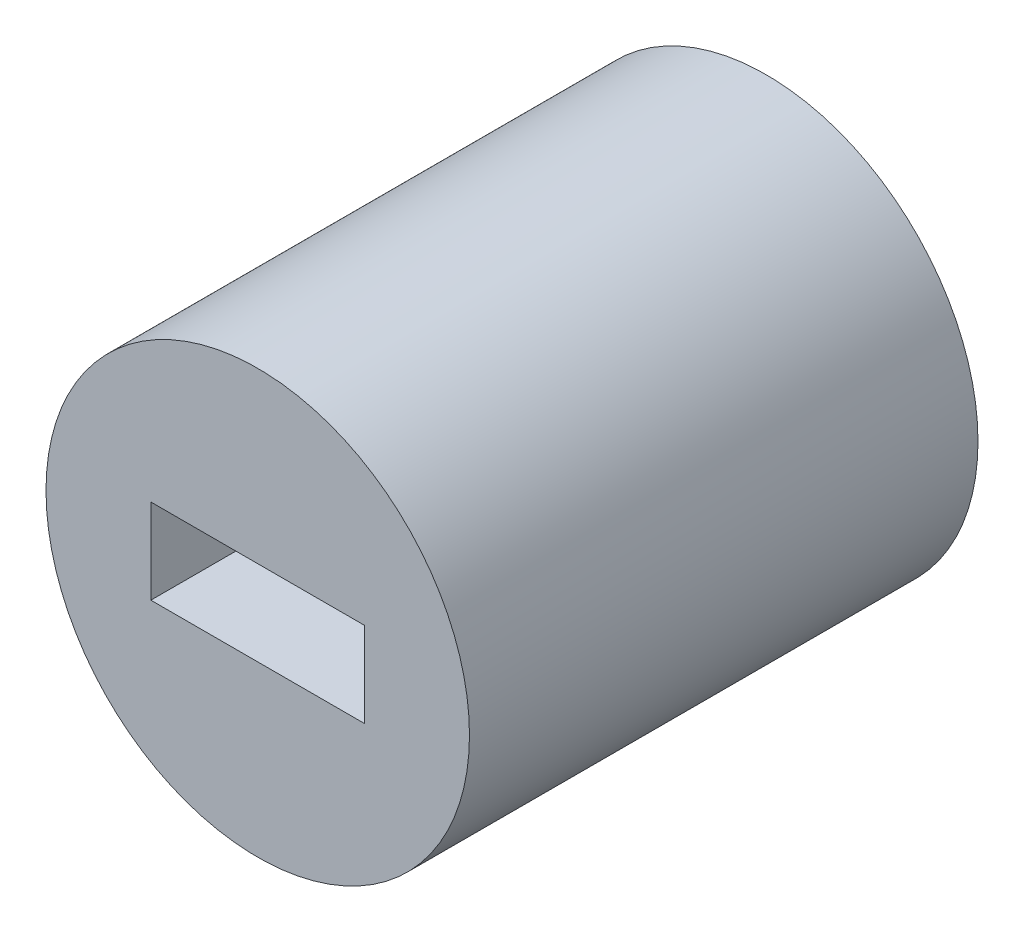
ISO-10303-21;
HEADER;
FILE_DESCRIPTION(('STEP AP214'),'2;1');
FILE_NAME('part.step','',(''),(''),'','','');
FILE_SCHEMA(('AUTOMOTIVE_DESIGN { 1 0 10303 214 1 1 1 1 }'));
ENDSEC;
DATA;
#1=APPLICATION_CONTEXT('core data for automotive mechanical design processes');
#2=APPLICATION_PROTOCOL_DEFINITION('international standard','automotive_design',2000,#1);
#3=PRODUCT_CONTEXT('',#1,'mechanical');
#4=PRODUCT('Part','Part','',(#3));
#5=PRODUCT_RELATED_PRODUCT_CATEGORY('part','',(#4));
#6=PRODUCT_DEFINITION_FORMATION('','',#4);
#7=PRODUCT_DEFINITION_CONTEXT('part definition',#1,'design');
#8=PRODUCT_DEFINITION('design','',#6,#7);
#9=PRODUCT_DEFINITION_SHAPE('','',#8);
#10=(LENGTH_UNIT() NAMED_UNIT(*) SI_UNIT(.MILLI.,.METRE.));
#11=(NAMED_UNIT(*) PLANE_ANGLE_UNIT() SI_UNIT($,.RADIAN.));
#12=(NAMED_UNIT(*) SI_UNIT($,.STERADIAN.) SOLID_ANGLE_UNIT());
#13=UNCERTAINTY_MEASURE_WITH_UNIT(LENGTH_MEASURE(1.E-05),#10,'distance_accuracy_value','');
#14=(GEOMETRIC_REPRESENTATION_CONTEXT(3) GLOBAL_UNCERTAINTY_ASSIGNED_CONTEXT((#13)) GLOBAL_UNIT_ASSIGNED_CONTEXT((#10,
#11,#12)) REPRESENTATION_CONTEXT('',''));
#15=CARTESIAN_POINT('',(0.,0.,0.));
#16=DIRECTION('',(0.,0.,1.));
#17=DIRECTION('',(1.,0.,0.));
#18=AXIS2_PLACEMENT_3D('',#15,#16,#17);
#19=CARTESIAN_POINT('',(-0.64100581951225,0.,3.05));
#20=DIRECTION('',(1.,0.,0.));
#21=DIRECTION('',(0.,1.,0.));
#22=AXIS2_PLACEMENT_3D('',#19,#20,#21);
#23=PLANE('',#22);
#24=DIRECTION('',(0.,1.,0.));
#25=VECTOR('',#24,1.);
#26=CARTESIAN_POINT('',(-0.64100581951225,0.,1.55));
#27=LINE('',#26,#25);
#28=CARTESIAN_POINT('',(-0.64100581951225,0.255,1.55));
#29=VERTEX_POINT('',#28);
#30=CARTESIAN_POINT('',(-0.64100581951225,-0.255,1.55));
#31=VERTEX_POINT('',#30);
#32=EDGE_CURVE('E112',#29,#31,#27,.F.);
#33=ORIENTED_EDGE('',*,*,#32,.F.);
#34=DIRECTION('',(0.,0.,1.));
#35=VECTOR('',#34,1.);
#36=CARTESIAN_POINT('',(-0.64100581951225,0.255,3.05));
#37=LINE('',#36,#35);
#38=CARTESIAN_POINT('',(-0.64100581951225,0.255,3.05));
#39=VERTEX_POINT('',#38);
#40=EDGE_CURVE('E120',#39,#29,#37,.F.);
#41=ORIENTED_EDGE('',*,*,#40,.F.);
#42=DIRECTION('',(0.,1.,0.));
#43=VECTOR('',#42,1.);
#44=CARTESIAN_POINT('',(-0.64100581951225,0.,3.05));
#45=LINE('',#44,#43);
#46=CARTESIAN_POINT('',(-0.64100581951225,-0.255,3.05));
#47=VERTEX_POINT('',#46);
#48=EDGE_CURVE('E30',#39,#47,#45,.F.);
#49=ORIENTED_EDGE('',*,*,#48,.T.);
#50=DIRECTION('',(0.,0.,1.));
#51=VECTOR('',#50,1.);
#52=CARTESIAN_POINT('',(-0.64100581951225,-0.255,3.05));
#53=LINE('',#52,#51);
#54=EDGE_CURVE('E117',#31,#47,#53,.T.);
#55=ORIENTED_EDGE('',*,*,#54,.F.);
#56=EDGE_LOOP('',(#33,#41,#49,#55));
#57=FACE_BOUND('',#56,.T.);
#58=ADVANCED_FACE('F14',(#57),#23,.T.);
#59=CARTESIAN_POINT('',(0.,0.,1.55));
#60=DIRECTION('',(0.,0.,1.));
#61=DIRECTION('',(1.,0.,0.));
#62=AXIS2_PLACEMENT_3D('',#59,#60,#61);
#63=PLANE('',#62);
#64=DIRECTION('',(-1.,0.,0.));
#65=VECTOR('',#64,1.);
#66=CARTESIAN_POINT('',(0.528723609904574,-0.255,1.55));
#67=LINE('',#66,#65);
#68=CARTESIAN_POINT('',(-0.416441400296898,-0.255,1.55));
#69=VERTEX_POINT('',#68);
#70=EDGE_CURVE('E125',#69,#31,#67,.T.);
#71=ORIENTED_EDGE('',*,*,#70,.F.);
#72=DIRECTION('',(0.,-1.,0.));
#73=VECTOR('',#72,1.);
#74=CARTESIAN_POINT('',(-0.416441400296898,0.,1.55));
#75=LINE('',#74,#73);
#76=CARTESIAN_POINT('',(-0.416441400296898,0.255,1.55));
#77=VERTEX_POINT('',#76);
#78=EDGE_CURVE('E110',#69,#77,#75,.F.);
#79=ORIENTED_EDGE('',*,*,#78,.T.);
#80=DIRECTION('',(1.,0.,0.));
#81=VECTOR('',#80,1.);
#82=CARTESIAN_POINT('',(-0.528723609904574,0.255,1.55));
#83=LINE('',#82,#81);
#84=EDGE_CURVE('E146',#29,#77,#83,.T.);
#85=ORIENTED_EDGE('',*,*,#84,.F.);
#86=ORIENTED_EDGE('',*,*,#32,.T.);
#87=EDGE_LOOP('',(#71,#79,#85,#86));
#88=FACE_BOUND('',#87,.T.);
#89=ADVANCED_FACE('F157',(#88),#63,.T.);
#90=CARTESIAN_POINT('',(-0.416441400296898,0.,3.05));
#91=DIRECTION('',(-1.,0.,0.));
#92=DIRECTION('',(0.,-1.,0.));
#93=AXIS2_PLACEMENT_3D('',#90,#91,#92);
#94=PLANE('',#93);
#95=DIRECTION('',(0.,0.,1.));
#96=VECTOR('',#95,1.);
#97=CARTESIAN_POINT('',(-0.416441400296898,0.255,3.05));
#98=LINE('',#97,#96);
#99=CARTESIAN_POINT('',(-0.416441400296898,0.255,0.));
#100=VERTEX_POINT('',#99);
#101=EDGE_CURVE('E143',#77,#100,#98,.F.);
#102=ORIENTED_EDGE('',*,*,#101,.F.);
#103=ORIENTED_EDGE('',*,*,#78,.F.);
#104=DIRECTION('',(0.,0.,1.));
#105=VECTOR('',#104,1.);
#106=CARTESIAN_POINT('',(-0.416441400296898,-0.255,3.05));
#107=LINE('',#106,#105);
#108=CARTESIAN_POINT('',(-0.416441400296898,-0.255,0.));
#109=VERTEX_POINT('',#108);
#110=EDGE_CURVE('E94',#109,#69,#107,.T.);
#111=ORIENTED_EDGE('',*,*,#110,.F.);
#112=DIRECTION('',(0.,-1.,0.));
#113=VECTOR('',#112,1.);
#114=CARTESIAN_POINT('',(-0.416441400296898,0.,0.));
#115=LINE('',#114,#113);
#116=EDGE_CURVE('E108',#100,#109,#115,.T.);
#117=ORIENTED_EDGE('',*,*,#116,.F.);
#118=EDGE_LOOP('',(#102,#103,#111,#117));
#119=FACE_BOUND('',#118,.T.);
#120=ADVANCED_FACE('F154',(#119),#94,.F.);
#121=CARTESIAN_POINT('',(0.416441400296898,0.,3.05));
#122=DIRECTION('',(1.,0.,0.));
#123=DIRECTION('',(0.,1.,0.));
#124=AXIS2_PLACEMENT_3D('',#121,#122,#123);
#125=PLANE('',#124);
#126=DIRECTION('',(0.,0.,1.));
#127=VECTOR('',#126,1.);
#128=CARTESIAN_POINT('',(0.416441400296898,-0.255,3.05));
#129=LINE('',#128,#127);
#130=CARTESIAN_POINT('',(0.416441400296898,-0.255,1.55));
#131=VERTEX_POINT('',#130);
#132=CARTESIAN_POINT('',(0.416441400296898,-0.255,0.));
#133=VERTEX_POINT('',#132);
#134=EDGE_CURVE('E89',#131,#133,#129,.F.);
#135=ORIENTED_EDGE('',*,*,#134,.F.);
#136=DIRECTION('',(0.,1.,0.));
#137=VECTOR('',#136,1.);
#138=CARTESIAN_POINT('',(0.416441400296898,0.,1.55));
#139=LINE('',#138,#137);
#140=CARTESIAN_POINT('',(0.416441400296898,0.255,1.55));
#141=VERTEX_POINT('',#140);
#142=EDGE_CURVE('E77',#141,#131,#139,.F.);
#143=ORIENTED_EDGE('',*,*,#142,.F.);
#144=DIRECTION('',(0.,0.,1.));
#145=VECTOR('',#144,1.);
#146=CARTESIAN_POINT('',(0.416441400296898,0.255,3.05));
#147=LINE('',#146,#145);
#148=CARTESIAN_POINT('',(0.416441400296898,0.255,0.));
#149=VERTEX_POINT('',#148);
#150=EDGE_CURVE('E141',#149,#141,#147,.T.);
#151=ORIENTED_EDGE('',*,*,#150,.F.);
#152=DIRECTION('',(0.,1.,0.));
#153=VECTOR('',#152,1.);
#154=CARTESIAN_POINT('',(0.416441400296898,0.,0.));
#155=LINE('',#154,#153);
#156=EDGE_CURVE('E86',#133,#149,#155,.T.);
#157=ORIENTED_EDGE('',*,*,#156,.F.);
#158=EDGE_LOOP('',(#135,#143,#151,#157));
#159=FACE_BOUND('',#158,.T.);
#160=ADVANCED_FACE('F90',(#159),#125,.F.);
#161=CARTESIAN_POINT('',(0.,0.,1.55));
#162=DIRECTION('',(0.,0.,1.));
#163=DIRECTION('',(1.,0.,0.));
#164=AXIS2_PLACEMENT_3D('',#161,#162,#163);
#165=PLANE('',#164);
#166=ORIENTED_EDGE('',*,*,#142,.T.);
#167=DIRECTION('',(-1.,0.,0.));
#168=VECTOR('',#167,1.);
#169=CARTESIAN_POINT('',(0.528723609904574,-0.255,1.55));
#170=LINE('',#169,#168);
#171=CARTESIAN_POINT('',(0.64100581951225,-0.255,1.55));
#172=VERTEX_POINT('',#171);
#173=EDGE_CURVE('E74',#172,#131,#170,.T.);
#174=ORIENTED_EDGE('',*,*,#173,.F.);
#175=DIRECTION('',(0.,-1.,0.));
#176=VECTOR('',#175,1.);
#177=CARTESIAN_POINT('',(0.64100581951225,0.,1.55));
#178=LINE('',#177,#176);
#179=CARTESIAN_POINT('',(0.64100581951225,0.255,1.55));
#180=VERTEX_POINT('',#179);
#181=EDGE_CURVE('E85',#180,#172,#178,.T.);
#182=ORIENTED_EDGE('',*,*,#181,.F.);
#183=DIRECTION('',(1.,0.,0.));
#184=VECTOR('',#183,1.);
#185=CARTESIAN_POINT('',(-0.528723609904574,0.255,1.55));
#186=LINE('',#185,#184);
#187=EDGE_CURVE('E81',#141,#180,#186,.T.);
#188=ORIENTED_EDGE('',*,*,#187,.F.);
#189=EDGE_LOOP('',(#166,#174,#182,#188));
#190=FACE_BOUND('',#189,.T.);
#191=ADVANCED_FACE('F79',(#190),#165,.T.);
#192=CARTESIAN_POINT('',(0.64100581951225,0.,3.05));
#193=DIRECTION('',(-1.,0.,0.));
#194=DIRECTION('',(0.,-1.,0.));
#195=AXIS2_PLACEMENT_3D('',#192,#193,#194);
#196=PLANE('',#195);
#197=DIRECTION('',(0.,-1.,0.));
#198=VECTOR('',#197,1.);
#199=CARTESIAN_POINT('',(0.64100581951225,0.,3.05));
#200=LINE('',#199,#198);
#201=CARTESIAN_POINT('',(0.64100581951225,-0.255,3.05));
#202=VERTEX_POINT('',#201);
#203=CARTESIAN_POINT('',(0.64100581951225,0.255,3.05));
#204=VERTEX_POINT('',#203);
#205=EDGE_CURVE('E101',#202,#204,#200,.F.);
#206=ORIENTED_EDGE('',*,*,#205,.T.);
#207=DIRECTION('',(0.,0.,1.));
#208=VECTOR('',#207,1.);
#209=CARTESIAN_POINT('',(0.64100581951225,0.255,3.05));
#210=LINE('',#209,#208);
#211=EDGE_CURVE('E137',#180,#204,#210,.T.);
#212=ORIENTED_EDGE('',*,*,#211,.F.);
#213=ORIENTED_EDGE('',*,*,#181,.T.);
#214=DIRECTION('',(0.,0.,1.));
#215=VECTOR('',#214,1.);
#216=CARTESIAN_POINT('',(0.64100581951225,-0.255,3.05));
#217=LINE('',#216,#215);
#218=EDGE_CURVE('E100',#202,#172,#217,.F.);
#219=ORIENTED_EDGE('',*,*,#218,.F.);
#220=EDGE_LOOP('',(#206,#212,#213,#219));
#221=FACE_BOUND('',#220,.T.);
#222=ADVANCED_FACE('F162',(#221),#196,.T.);
#223=CARTESIAN_POINT('',(0.528723609904574,-0.255,3.05));
#224=DIRECTION('',(0.,1.,0.));
#225=DIRECTION('',(-1.,0.,0.));
#226=AXIS2_PLACEMENT_3D('',#223,#224,#225);
#227=PLANE('',#226);
#228=DIRECTION('',(1.,0.,0.));
#229=VECTOR('',#228,1.);
#230=CARTESIAN_POINT('',(0.,-0.255,3.05));
#231=LINE('',#230,#229);
#232=EDGE_CURVE('E122',#202,#47,#231,.F.);
#233=ORIENTED_EDGE('',*,*,#232,.F.);
#234=ORIENTED_EDGE('',*,*,#218,.T.);
#235=ORIENTED_EDGE('',*,*,#173,.T.);
#236=ORIENTED_EDGE('',*,*,#134,.T.);
#237=DIRECTION('',(1.,0.,0.));
#238=VECTOR('',#237,1.);
#239=CARTESIAN_POINT('',(0.,-0.255,0.));
#240=LINE('',#239,#238);
#241=EDGE_CURVE('E133',#133,#109,#240,.F.);
#242=ORIENTED_EDGE('',*,*,#241,.T.);
#243=ORIENTED_EDGE('',*,*,#110,.T.);
#244=ORIENTED_EDGE('',*,*,#70,.T.);
#245=ORIENTED_EDGE('',*,*,#54,.T.);
#246=EDGE_LOOP('',(#233,#234,#235,#236,#242,#243,#244,#245));
#247=FACE_BOUND('',#246,.T.);
#248=ADVANCED_FACE('F98',(#247),#227,.T.);
#249=CARTESIAN_POINT('',(-0.528723609904574,0.255,3.05));
#250=DIRECTION('',(0.,-1.,0.));
#251=DIRECTION('',(1.,0.,0.));
#252=AXIS2_PLACEMENT_3D('',#249,#250,#251);
#253=PLANE('',#252);
#254=ORIENTED_EDGE('',*,*,#187,.T.);
#255=ORIENTED_EDGE('',*,*,#211,.T.);
#256=DIRECTION('',(1.,0.,0.));
#257=VECTOR('',#256,1.);
#258=CARTESIAN_POINT('',(0.,0.255,3.05));
#259=LINE('',#258,#257);
#260=EDGE_CURVE('E128',#39,#204,#259,.T.);
#261=ORIENTED_EDGE('',*,*,#260,.F.);
#262=ORIENTED_EDGE('',*,*,#40,.T.);
#263=ORIENTED_EDGE('',*,*,#84,.T.);
#264=ORIENTED_EDGE('',*,*,#101,.T.);
#265=DIRECTION('',(1.,0.,0.));
#266=VECTOR('',#265,1.);
#267=CARTESIAN_POINT('',(0.,0.255,0.));
#268=LINE('',#267,#266);
#269=EDGE_CURVE('E129',#100,#149,#268,.T.);
#270=ORIENTED_EDGE('',*,*,#269,.T.);
#271=ORIENTED_EDGE('',*,*,#150,.T.);
#272=EDGE_LOOP('',(#254,#255,#261,#262,#263,#264,#270,#271));
#273=FACE_BOUND('',#272,.T.);
#274=ADVANCED_FACE('F159',(#273),#253,.T.);
#275=CARTESIAN_POINT('',(0.,0.,0.));
#276=DIRECTION('',(0.,0.,1.));
#277=DIRECTION('',(1.,0.,0.));
#278=AXIS2_PLACEMENT_3D('',#275,#276,#277);
#279=PLANE('',#278);
#280=CARTESIAN_POINT('',(0.,0.,0.));
#281=DIRECTION('',(0.,0.,1.));
#282=DIRECTION('',(1.,0.,0.));
#283=AXIS2_PLACEMENT_3D('',#280,#281,#282);
#284=CIRCLE('',#283,1.27);
#285=CARTESIAN_POINT('',(1.27,0.,0.));
#286=VERTEX_POINT('',#285);
#287=EDGE_CURVE('E17',#286,#286,#284,.T.);
#288=ORIENTED_EDGE('',*,*,#287,.F.);
#289=EDGE_LOOP('',(#288));
#290=FACE_BOUND('',#289,.T.);
#291=ORIENTED_EDGE('',*,*,#116,.T.);
#292=ORIENTED_EDGE('',*,*,#241,.F.);
#293=ORIENTED_EDGE('',*,*,#156,.T.);
#294=ORIENTED_EDGE('',*,*,#269,.F.);
#295=EDGE_LOOP('',(#291,#292,#293,#294));
#296=FACE_BOUND('',#295,.T.);
#297=ADVANCED_FACE('F179',(#290,#296),#279,.F.);
#298=CARTESIAN_POINT('',(0.,0.,3.05));
#299=DIRECTION('',(0.,0.,1.));
#300=DIRECTION('',(1.,0.,0.));
#301=AXIS2_PLACEMENT_3D('',#298,#299,#300);
#302=PLANE('',#301);
#303=CARTESIAN_POINT('',(0.,0.,3.05));
#304=DIRECTION('',(0.,0.,1.));
#305=DIRECTION('',(1.,0.,0.));
#306=AXIS2_PLACEMENT_3D('',#303,#304,#305);
#307=CIRCLE('',#306,1.27);
#308=CARTESIAN_POINT('',(1.27,0.,3.05));
#309=VERTEX_POINT('',#308);
#310=EDGE_CURVE('E9',#309,#309,#307,.F.);
#311=ORIENTED_EDGE('',*,*,#310,.F.);
#312=EDGE_LOOP('',(#311));
#313=FACE_BOUND('',#312,.T.);
#314=ORIENTED_EDGE('',*,*,#48,.F.);
#315=ORIENTED_EDGE('',*,*,#260,.T.);
#316=ORIENTED_EDGE('',*,*,#205,.F.);
#317=ORIENTED_EDGE('',*,*,#232,.T.);
#318=EDGE_LOOP('',(#314,#315,#316,#317));
#319=FACE_BOUND('',#318,.T.);
#320=ADVANCED_FACE('F127',(#313,#319),#302,.T.);
#321=CARTESIAN_POINT('',(0.,0.,0.));
#322=DIRECTION('',(0.,0.,1.));
#323=DIRECTION('',(1.,0.,0.));
#324=AXIS2_PLACEMENT_3D('',#321,#322,#323);
#325=CYLINDRICAL_SURFACE('',#324,1.27);
#326=ORIENTED_EDGE('',*,*,#287,.T.);
#327=EDGE_LOOP('',(#326));
#328=FACE_BOUND('',#327,.T.);
#329=ORIENTED_EDGE('',*,*,#310,.T.);
#330=EDGE_LOOP('',(#329));
#331=FACE_BOUND('',#330,.T.);
#332=ADVANCED_FACE('F172',(#328,#331),#325,.T.);
#333=CLOSED_SHELL('',(#58,#89,#120,#160,#191,#222,#248,#274,#297,#320,#332));
#334=MANIFOLD_SOLID_BREP('B1',#333);
#335=ADVANCED_BREP_SHAPE_REPRESENTATION('',(#18,#334),#14);
#336=SHAPE_DEFINITION_REPRESENTATION(#9,#335);
ENDSEC;
END-ISO-10303-21;
